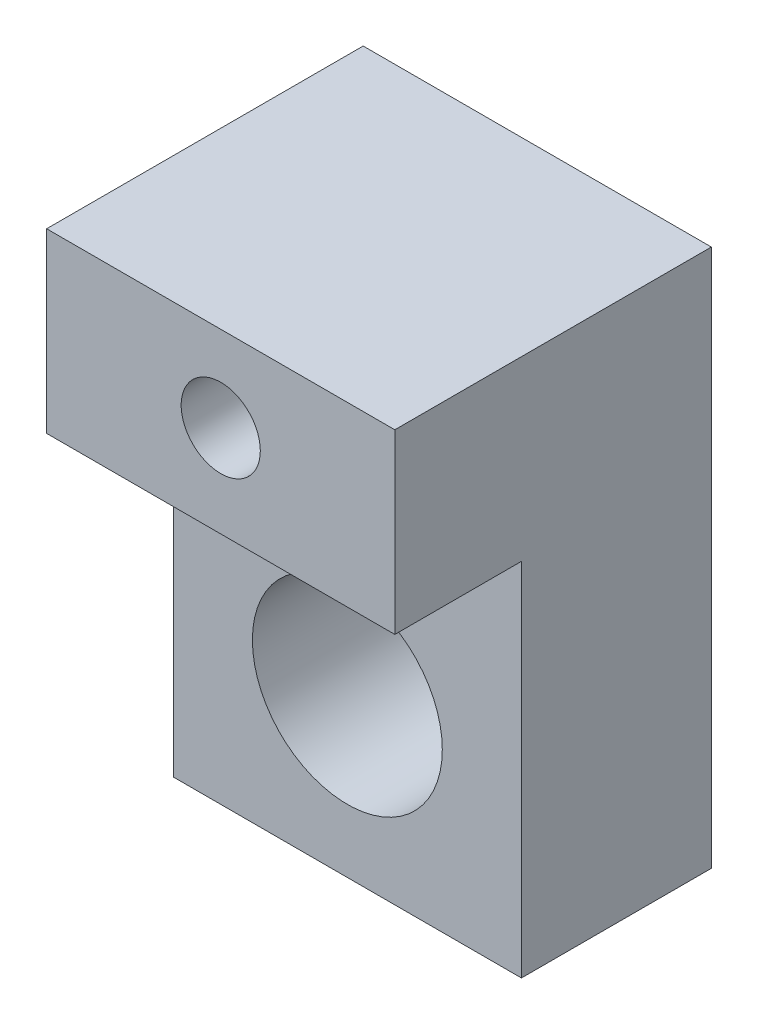
ISO-10303-21;
HEADER;
FILE_DESCRIPTION(('STEP AP214'),'2;1');
FILE_NAME('part.step','',(''),(''),'','','');
FILE_SCHEMA(('AUTOMOTIVE_DESIGN { 1 0 10303 214 1 1 1 1 }'));
ENDSEC;
DATA;
#1=APPLICATION_CONTEXT('core data for automotive mechanical design processes');
#2=APPLICATION_PROTOCOL_DEFINITION('international standard','automotive_design',2000,#1);
#3=PRODUCT_CONTEXT('',#1,'mechanical');
#4=PRODUCT('Part','Part','',(#3));
#5=PRODUCT_RELATED_PRODUCT_CATEGORY('part','',(#4));
#6=PRODUCT_DEFINITION_FORMATION('','',#4);
#7=PRODUCT_DEFINITION_CONTEXT('part definition',#1,'design');
#8=PRODUCT_DEFINITION('design','',#6,#7);
#9=PRODUCT_DEFINITION_SHAPE('','',#8);
#10=(LENGTH_UNIT() NAMED_UNIT(*) SI_UNIT(.MILLI.,.METRE.));
#11=(NAMED_UNIT(*) PLANE_ANGLE_UNIT() SI_UNIT($,.RADIAN.));
#12=(NAMED_UNIT(*) SI_UNIT($,.STERADIAN.) SOLID_ANGLE_UNIT());
#13=UNCERTAINTY_MEASURE_WITH_UNIT(LENGTH_MEASURE(1.E-05),#10,'distance_accuracy_value','');
#14=(GEOMETRIC_REPRESENTATION_CONTEXT(3) GLOBAL_UNCERTAINTY_ASSIGNED_CONTEXT((#13)) GLOBAL_UNIT_ASSIGNED_CONTEXT((#10,
#11,#12)) REPRESENTATION_CONTEXT('',''));
#15=CARTESIAN_POINT('',(0.,0.,0.));
#16=DIRECTION('',(0.,0.,1.));
#17=DIRECTION('',(1.,0.,0.));
#18=AXIS2_PLACEMENT_3D('',#15,#16,#17);
#19=CARTESIAN_POINT('',(-2.75,4.25,3.));
#20=DIRECTION('',(1.,0.,0.));
#21=DIRECTION('',(0.,1.,0.));
#22=AXIS2_PLACEMENT_3D('',#19,#20,#21);
#23=PLANE('',#22);
#24=DIRECTION('',(0.,-1.,0.));
#25=VECTOR('',#24,1.);
#26=CARTESIAN_POINT('',(-2.75,4.25,3.));
#27=LINE('',#26,#25);
#28=CARTESIAN_POINT('',(-2.75,1.45,3.));
#29=VERTEX_POINT('',#28);
#30=CARTESIAN_POINT('',(-2.75,-4.25,3.));
#31=VERTEX_POINT('',#30);
#32=EDGE_CURVE('E93',#29,#31,#27,.T.);
#33=ORIENTED_EDGE('',*,*,#32,.F.);
#34=DIRECTION('',(0.,0.,-1.));
#35=VECTOR('',#34,1.);
#36=CARTESIAN_POINT('',(-2.75,1.45,5.));
#37=LINE('',#36,#35);
#38=CARTESIAN_POINT('',(-2.75,1.45,5.));
#39=VERTEX_POINT('',#38);
#40=EDGE_CURVE('E126',#39,#29,#37,.T.);
#41=ORIENTED_EDGE('',*,*,#40,.F.);
#42=DIRECTION('',(0.,1.,0.));
#43=VECTOR('',#42,1.);
#44=CARTESIAN_POINT('',(-2.75,4.25,5.));
#45=LINE('',#44,#43);
#46=CARTESIAN_POINT('',(-2.75,4.25,5.));
#47=VERTEX_POINT('',#46);
#48=EDGE_CURVE('E102',#39,#47,#45,.T.);
#49=ORIENTED_EDGE('',*,*,#48,.T.);
#50=DIRECTION('',(0.,0.,-1.));
#51=VECTOR('',#50,1.);
#52=CARTESIAN_POINT('',(-2.75,4.25,3.));
#53=LINE('',#52,#51);
#54=CARTESIAN_POINT('',(-2.75,4.25,0.));
#55=VERTEX_POINT('',#54);
#56=EDGE_CURVE('E86',#47,#55,#53,.T.);
#57=ORIENTED_EDGE('',*,*,#56,.T.);
#58=DIRECTION('',(0.,-1.,0.));
#59=VECTOR('',#58,1.);
#60=CARTESIAN_POINT('',(-2.75,4.25,0.));
#61=LINE('',#60,#59);
#62=CARTESIAN_POINT('',(-2.75,-4.25,0.));
#63=VERTEX_POINT('',#62);
#64=EDGE_CURVE('E98',#55,#63,#61,.T.);
#65=ORIENTED_EDGE('',*,*,#64,.T.);
#66=DIRECTION('',(0.,0.,-1.));
#67=VECTOR('',#66,1.);
#68=CARTESIAN_POINT('',(-2.75,-4.25,3.));
#69=LINE('',#68,#67);
#70=EDGE_CURVE('E11',#31,#63,#69,.T.);
#71=ORIENTED_EDGE('',*,*,#70,.F.);
#72=EDGE_LOOP('',(#33,#41,#49,#57,#65,#71));
#73=FACE_BOUND('',#72,.T.);
#74=ADVANCED_FACE('F40',(#73),#23,.F.);
#75=CARTESIAN_POINT('',(-2.75,-4.25,3.));
#76=DIRECTION('',(0.,1.,0.));
#77=DIRECTION('',(0.,0.,1.));
#78=AXIS2_PLACEMENT_3D('',#75,#76,#77);
#79=PLANE('',#78);
#80=DIRECTION('',(1.,0.,0.));
#81=VECTOR('',#80,1.);
#82=CARTESIAN_POINT('',(-2.75,-4.25,0.));
#83=LINE('',#82,#81);
#84=CARTESIAN_POINT('',(2.75,-4.25,0.));
#85=VERTEX_POINT('',#84);
#86=EDGE_CURVE('E107',#63,#85,#83,.T.);
#87=ORIENTED_EDGE('',*,*,#86,.T.);
#88=DIRECTION('',(0.,0.,-1.));
#89=VECTOR('',#88,1.);
#90=CARTESIAN_POINT('',(2.75,-4.25,3.));
#91=LINE('',#90,#89);
#92=CARTESIAN_POINT('',(2.75,-4.25,3.));
#93=VERTEX_POINT('',#92);
#94=EDGE_CURVE('E48',#93,#85,#91,.T.);
#95=ORIENTED_EDGE('',*,*,#94,.F.);
#96=DIRECTION('',(1.,0.,0.));
#97=VECTOR('',#96,1.);
#98=CARTESIAN_POINT('',(-2.75,-4.25,3.));
#99=LINE('',#98,#97);
#100=EDGE_CURVE('E61',#31,#93,#99,.T.);
#101=ORIENTED_EDGE('',*,*,#100,.F.);
#102=ORIENTED_EDGE('',*,*,#70,.T.);
#103=EDGE_LOOP('',(#87,#95,#101,#102));
#104=FACE_BOUND('',#103,.T.);
#105=ADVANCED_FACE('F123',(#104),#79,.F.);
#106=CARTESIAN_POINT('',(2.75,4.25,3.));
#107=DIRECTION('',(-1.,0.,0.));
#108=DIRECTION('',(0.,-1.,0.));
#109=AXIS2_PLACEMENT_3D('',#106,#107,#108);
#110=PLANE('',#109);
#111=DIRECTION('',(0.,1.,0.));
#112=VECTOR('',#111,1.);
#113=CARTESIAN_POINT('',(2.75,4.25,0.));
#114=LINE('',#113,#112);
#115=CARTESIAN_POINT('',(2.75,4.25,0.));
#116=VERTEX_POINT('',#115);
#117=EDGE_CURVE('E94',#85,#116,#114,.T.);
#118=ORIENTED_EDGE('',*,*,#117,.T.);
#119=DIRECTION('',(0.,0.,-1.));
#120=VECTOR('',#119,1.);
#121=CARTESIAN_POINT('',(2.75,4.25,3.));
#122=LINE('',#121,#120);
#123=CARTESIAN_POINT('',(2.75,4.25,5.));
#124=VERTEX_POINT('',#123);
#125=EDGE_CURVE('E89',#124,#116,#122,.T.);
#126=ORIENTED_EDGE('',*,*,#125,.F.);
#127=DIRECTION('',(0.,-1.,0.));
#128=VECTOR('',#127,1.);
#129=CARTESIAN_POINT('',(2.75,4.25,5.));
#130=LINE('',#129,#128);
#131=CARTESIAN_POINT('',(2.75,1.45,5.));
#132=VERTEX_POINT('',#131);
#133=EDGE_CURVE('E165',#124,#132,#130,.T.);
#134=ORIENTED_EDGE('',*,*,#133,.T.);
#135=DIRECTION('',(0.,0.,-1.));
#136=VECTOR('',#135,1.);
#137=CARTESIAN_POINT('',(2.75,1.45,5.));
#138=LINE('',#137,#136);
#139=CARTESIAN_POINT('',(2.75,1.45,3.));
#140=VERTEX_POINT('',#139);
#141=EDGE_CURVE('E134',#132,#140,#138,.T.);
#142=ORIENTED_EDGE('',*,*,#141,.T.);
#143=DIRECTION('',(0.,1.,0.));
#144=VECTOR('',#143,1.);
#145=CARTESIAN_POINT('',(2.75,4.25,3.));
#146=LINE('',#145,#144);
#147=EDGE_CURVE('E104',#93,#140,#146,.T.);
#148=ORIENTED_EDGE('',*,*,#147,.F.);
#149=ORIENTED_EDGE('',*,*,#94,.T.);
#150=EDGE_LOOP('',(#118,#126,#134,#142,#148,#149));
#151=FACE_BOUND('',#150,.T.);
#152=ADVANCED_FACE('F120',(#151),#110,.F.);
#153=CARTESIAN_POINT('',(-2.75,4.25,3.));
#154=DIRECTION('',(0.,-1.,0.));
#155=DIRECTION('',(0.,0.,-1.));
#156=AXIS2_PLACEMENT_3D('',#153,#154,#155);
#157=PLANE('',#156);
#158=DIRECTION('',(-1.,0.,0.));
#159=VECTOR('',#158,1.);
#160=CARTESIAN_POINT('',(-2.75,4.25,0.));
#161=LINE('',#160,#159);
#162=EDGE_CURVE('E81',#116,#55,#161,.T.);
#163=ORIENTED_EDGE('',*,*,#162,.T.);
#164=ORIENTED_EDGE('',*,*,#56,.F.);
#165=DIRECTION('',(1.,0.,0.));
#166=VECTOR('',#165,1.);
#167=CARTESIAN_POINT('',(2.75,4.25,5.));
#168=LINE('',#167,#166);
#169=EDGE_CURVE('E137',#47,#124,#168,.T.);
#170=ORIENTED_EDGE('',*,*,#169,.T.);
#171=ORIENTED_EDGE('',*,*,#125,.T.);
#172=EDGE_LOOP('',(#163,#164,#170,#171));
#173=FACE_BOUND('',#172,.T.);
#174=ADVANCED_FACE('F83',(#173),#157,.F.);
#175=CARTESIAN_POINT('',(0.,0.,3.));
#176=DIRECTION('',(0.,0.,1.));
#177=DIRECTION('',(1.,0.,0.));
#178=AXIS2_PLACEMENT_3D('',#175,#176,#177);
#179=PLANE('',#178);
#180=DIRECTION('',(1.,0.,0.));
#181=VECTOR('',#180,1.);
#182=CARTESIAN_POINT('',(0.,1.45,3.));
#183=LINE('',#182,#181);
#184=EDGE_CURVE('E55',#29,#140,#183,.T.);
#185=ORIENTED_EDGE('',*,*,#184,.F.);
#186=ORIENTED_EDGE('',*,*,#32,.T.);
#187=ORIENTED_EDGE('',*,*,#100,.T.);
#188=ORIENTED_EDGE('',*,*,#147,.T.);
#189=EDGE_LOOP('',(#185,#186,#187,#188));
#190=FACE_BOUND('',#189,.T.);
#191=CARTESIAN_POINT('',(0.,-1.75,3.));
#192=DIRECTION('',(0.,0.,1.));
#193=DIRECTION('',(1.,0.,0.));
#194=AXIS2_PLACEMENT_3D('',#191,#192,#193);
#195=CIRCLE('',#194,1.5);
#196=CARTESIAN_POINT('',(1.5,-1.75,3.));
#197=VERTEX_POINT('',#196);
#198=EDGE_CURVE('E111',#197,#197,#195,.T.);
#199=ORIENTED_EDGE('',*,*,#198,.F.);
#200=EDGE_LOOP('',(#199));
#201=FACE_BOUND('',#200,.T.);
#202=ADVANCED_FACE('F143',(#190,#201),#179,.T.);
#203=CARTESIAN_POINT('',(0.,0.,0.));
#204=DIRECTION('',(0.,0.,1.));
#205=DIRECTION('',(1.,0.,0.));
#206=AXIS2_PLACEMENT_3D('',#203,#204,#205);
#207=PLANE('',#206);
#208=CARTESIAN_POINT('',(0.,-1.75,0.));
#209=DIRECTION('',(0.,0.,1.));
#210=DIRECTION('',(1.,0.,0.));
#211=AXIS2_PLACEMENT_3D('',#208,#209,#210);
#212=CIRCLE('',#211,1.5);
#213=CARTESIAN_POINT('',(1.5,-1.75,0.));
#214=VERTEX_POINT('',#213);
#215=EDGE_CURVE('E43',#214,#214,#212,.T.);
#216=ORIENTED_EDGE('',*,*,#215,.T.);
#217=EDGE_LOOP('',(#216));
#218=FACE_BOUND('',#217,.T.);
#219=ORIENTED_EDGE('',*,*,#86,.F.);
#220=ORIENTED_EDGE('',*,*,#64,.F.);
#221=ORIENTED_EDGE('',*,*,#162,.F.);
#222=ORIENTED_EDGE('',*,*,#117,.F.);
#223=EDGE_LOOP('',(#219,#220,#221,#222));
#224=FACE_BOUND('',#223,.T.);
#225=ADVANCED_FACE('F106',(#218,#224),#207,.F.);
#226=CARTESIAN_POINT('',(0.,-1.75,-7.));
#227=DIRECTION('',(0.,0.,1.));
#228=DIRECTION('',(1.,0.,0.));
#229=AXIS2_PLACEMENT_3D('',#226,#227,#228);
#230=CYLINDRICAL_SURFACE('',#229,1.5);
#231=ORIENTED_EDGE('',*,*,#198,.T.);
#232=EDGE_LOOP('',(#231));
#233=FACE_BOUND('',#232,.T.);
#234=ORIENTED_EDGE('',*,*,#215,.F.);
#235=EDGE_LOOP('',(#234));
#236=FACE_BOUND('',#235,.T.);
#237=ADVANCED_FACE('F181',(#233,#236),#230,.F.);
#238=CARTESIAN_POINT('',(2.75,1.45,5.));
#239=DIRECTION('',(0.,-1.,0.));
#240=DIRECTION('',(0.,0.,-1.));
#241=AXIS2_PLACEMENT_3D('',#238,#239,#240);
#242=PLANE('',#241);
#243=ORIENTED_EDGE('',*,*,#40,.T.);
#244=ORIENTED_EDGE('',*,*,#184,.T.);
#245=ORIENTED_EDGE('',*,*,#141,.F.);
#246=DIRECTION('',(-1.,0.,0.));
#247=VECTOR('',#246,1.);
#248=CARTESIAN_POINT('',(2.75,1.45,5.));
#249=LINE('',#248,#247);
#250=EDGE_CURVE('E133',#132,#39,#249,.T.);
#251=ORIENTED_EDGE('',*,*,#250,.T.);
#252=EDGE_LOOP('',(#243,#244,#245,#251));
#253=FACE_BOUND('',#252,.T.);
#254=ADVANCED_FACE('F130',(#253),#242,.T.);
#255=CARTESIAN_POINT('',(0.,0.,5.));
#256=DIRECTION('',(0.,0.,-1.));
#257=DIRECTION('',(-1.,0.,0.));
#258=AXIS2_PLACEMENT_3D('',#255,#256,#257);
#259=PLANE('',#258);
#260=CARTESIAN_POINT('',(0.,2.9,5.));
#261=DIRECTION('',(0.,0.,1.));
#262=DIRECTION('',(1.,0.,0.));
#263=AXIS2_PLACEMENT_3D('',#260,#261,#262);
#264=CIRCLE('',#263,0.62499999999999);
#265=CARTESIAN_POINT('',(0.62499999999999,2.9,5.));
#266=VERTEX_POINT('',#265);
#267=EDGE_CURVE('E166',#266,#266,#264,.T.);
#268=ORIENTED_EDGE('',*,*,#267,.F.);
#269=EDGE_LOOP('',(#268));
#270=FACE_BOUND('',#269,.T.);
#271=ORIENTED_EDGE('',*,*,#133,.F.);
#272=ORIENTED_EDGE('',*,*,#169,.F.);
#273=ORIENTED_EDGE('',*,*,#48,.F.);
#274=ORIENTED_EDGE('',*,*,#250,.F.);
#275=EDGE_LOOP('',(#271,#272,#273,#274));
#276=FACE_BOUND('',#275,.T.);
#277=ADVANCED_FACE('F159',(#270,#276),#259,.F.);
#278=CARTESIAN_POINT('',(0.,2.9,1.));
#279=DIRECTION('',(0.,0.,1.));
#280=DIRECTION('',(1.,0.,0.));
#281=AXIS2_PLACEMENT_3D('',#278,#279,#280);
#282=CONICAL_SURFACE('',#281,0.624999999999999,1.02974425867665);
#283=CARTESIAN_POINT('',(0.,2.9,0.624462113107775));
#284=VERTEX_POINT('',#283);
#285=VERTEX_LOOP('',#284);
#286=FACE_BOUND('',#285,.T.);
#287=CARTESIAN_POINT('',(0.,2.9,1.));
#288=DIRECTION('',(0.,0.,1.));
#289=DIRECTION('',(1.,0.,0.));
#290=AXIS2_PLACEMENT_3D('',#287,#288,#289);
#291=CIRCLE('',#290,0.624999999999999);
#292=CARTESIAN_POINT('',(0.624999999999999,2.9,1.));
#293=VERTEX_POINT('',#292);
#294=EDGE_CURVE('E163',#293,#293,#291,.T.);
#295=ORIENTED_EDGE('',*,*,#294,.T.);
#296=EDGE_LOOP('',(#295));
#297=FACE_BOUND('',#296,.T.);
#298=ADVANCED_FACE('F155',(#286,#297),#282,.F.);
#299=CARTESIAN_POINT('',(0.,2.9,5.));
#300=DIRECTION('',(0.,0.,1.));
#301=DIRECTION('',(1.,0.,0.));
#302=AXIS2_PLACEMENT_3D('',#299,#300,#301);
#303=CYLINDRICAL_SURFACE('',#302,0.624999999999994);
#304=ORIENTED_EDGE('',*,*,#294,.F.);
#305=EDGE_LOOP('',(#304));
#306=FACE_BOUND('',#305,.T.);
#307=ORIENTED_EDGE('',*,*,#267,.T.);
#308=EDGE_LOOP('',(#307));
#309=FACE_BOUND('',#308,.T.);
#310=ADVANCED_FACE('F158',(#306,#309),#303,.F.);
#311=CLOSED_SHELL('',(#74,#105,#152,#174,#202,#225,#237,#254,#277,#298,#310));
#312=MANIFOLD_SOLID_BREP('B2',#311);
#313=ADVANCED_BREP_SHAPE_REPRESENTATION('',(#18,#312),#14);
#314=SHAPE_DEFINITION_REPRESENTATION(#9,#313);
ENDSEC;
END-ISO-10303-21;
